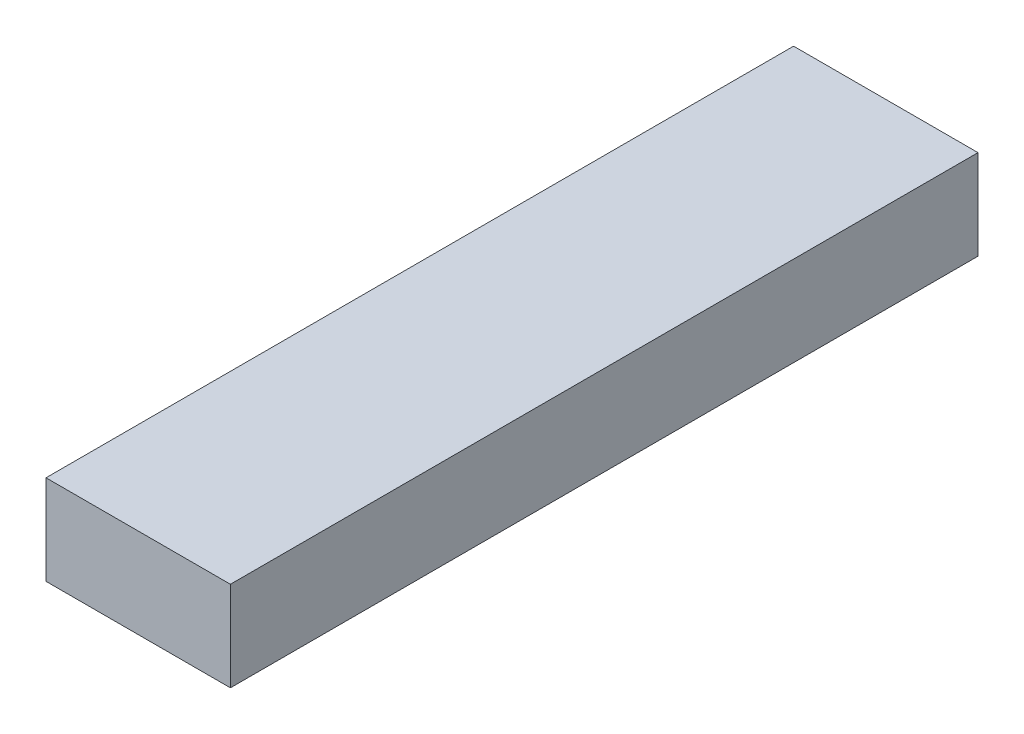
ISO-10303-21;
HEADER;
FILE_DESCRIPTION(('STEP AP214'),'2;1');
FILE_NAME('part.step','',(''),(''),'','','');
FILE_SCHEMA(('AUTOMOTIVE_DESIGN { 1 0 10303 214 1 1 1 1 }'));
ENDSEC;
DATA;
#1=APPLICATION_CONTEXT('core data for automotive mechanical design processes');
#2=APPLICATION_PROTOCOL_DEFINITION('international standard','automotive_design',2000,#1);
#3=PRODUCT_CONTEXT('',#1,'mechanical');
#4=PRODUCT('Part','Part','',(#3));
#5=PRODUCT_RELATED_PRODUCT_CATEGORY('part','',(#4));
#6=PRODUCT_DEFINITION_FORMATION('','',#4);
#7=PRODUCT_DEFINITION_CONTEXT('part definition',#1,'design');
#8=PRODUCT_DEFINITION('design','',#6,#7);
#9=PRODUCT_DEFINITION_SHAPE('','',#8);
#10=(LENGTH_UNIT() NAMED_UNIT(*) SI_UNIT(.MILLI.,.METRE.));
#11=(NAMED_UNIT(*) PLANE_ANGLE_UNIT() SI_UNIT($,.RADIAN.));
#12=(NAMED_UNIT(*) SI_UNIT($,.STERADIAN.) SOLID_ANGLE_UNIT());
#13=UNCERTAINTY_MEASURE_WITH_UNIT(LENGTH_MEASURE(1.E-05),#10,'distance_accuracy_value','');
#14=(GEOMETRIC_REPRESENTATION_CONTEXT(3) GLOBAL_UNCERTAINTY_ASSIGNED_CONTEXT((#13)) GLOBAL_UNIT_ASSIGNED_CONTEXT((#10,
#11,#12)) REPRESENTATION_CONTEXT('',''));
#15=CARTESIAN_POINT('',(0.,0.,0.));
#16=DIRECTION('',(0.,0.,1.));
#17=DIRECTION('',(1.,0.,0.));
#18=AXIS2_PLACEMENT_3D('',#15,#16,#17);
#19=CARTESIAN_POINT('',(1.85,-0.9,15.));
#20=DIRECTION('',(-1.,0.,0.));
#21=DIRECTION('',(0.,0.,1.));
#22=AXIS2_PLACEMENT_3D('',#19,#20,#21);
#23=PLANE('',#22);
#24=DIRECTION('',(0.,1.,0.));
#25=VECTOR('',#24,1.);
#26=CARTESIAN_POINT('',(1.85,-0.9,0.));
#27=LINE('',#26,#25);
#28=CARTESIAN_POINT('',(1.85,-0.9,0.));
#29=VERTEX_POINT('',#28);
#30=CARTESIAN_POINT('',(1.85,0.9,0.));
#31=VERTEX_POINT('',#30);
#32=EDGE_CURVE('E113',#29,#31,#27,.T.);
#33=ORIENTED_EDGE('',*,*,#32,.T.);
#34=DIRECTION('',(0.,0.,-1.));
#35=VECTOR('',#34,1.);
#36=CARTESIAN_POINT('',(1.85,0.9,15.));
#37=LINE('',#36,#35);
#38=CARTESIAN_POINT('',(1.85,0.9,15.));
#39=VERTEX_POINT('',#38);
#40=EDGE_CURVE('E11',#39,#31,#37,.T.);
#41=ORIENTED_EDGE('',*,*,#40,.F.);
#42=DIRECTION('',(0.,1.,0.));
#43=VECTOR('',#42,1.);
#44=CARTESIAN_POINT('',(1.85,-0.9,15.));
#45=LINE('',#44,#43);
#46=CARTESIAN_POINT('',(1.85,-0.9,15.));
#47=VERTEX_POINT('',#46);
#48=EDGE_CURVE('E97',#47,#39,#45,.T.);
#49=ORIENTED_EDGE('',*,*,#48,.F.);
#50=DIRECTION('',(0.,0.,-1.));
#51=VECTOR('',#50,1.);
#52=CARTESIAN_POINT('',(1.85,-0.9,15.));
#53=LINE('',#52,#51);
#54=EDGE_CURVE('E109',#47,#29,#53,.T.);
#55=ORIENTED_EDGE('',*,*,#54,.T.);
#56=EDGE_LOOP('',(#33,#41,#49,#55));
#57=FACE_BOUND('',#56,.T.);
#58=ADVANCED_FACE('F45',(#57),#23,.F.);
#59=CARTESIAN_POINT('',(-1.85,0.9,15.));
#60=DIRECTION('',(0.,-1.,0.));
#61=DIRECTION('',(0.,0.,-1.));
#62=AXIS2_PLACEMENT_3D('',#59,#60,#61);
#63=PLANE('',#62);
#64=DIRECTION('',(-1.,0.,0.));
#65=VECTOR('',#64,1.);
#66=CARTESIAN_POINT('',(-1.85,0.9,0.));
#67=LINE('',#66,#65);
#68=CARTESIAN_POINT('',(-1.85,0.9,0.));
#69=VERTEX_POINT('',#68);
#70=EDGE_CURVE('E102',#31,#69,#67,.T.);
#71=ORIENTED_EDGE('',*,*,#70,.T.);
#72=DIRECTION('',(0.,0.,-1.));
#73=VECTOR('',#72,1.);
#74=CARTESIAN_POINT('',(-1.85,0.9,15.));
#75=LINE('',#74,#73);
#76=CARTESIAN_POINT('',(-1.85,0.9,15.));
#77=VERTEX_POINT('',#76);
#78=EDGE_CURVE('E54',#77,#69,#75,.T.);
#79=ORIENTED_EDGE('',*,*,#78,.F.);
#80=DIRECTION('',(-1.,0.,0.));
#81=VECTOR('',#80,1.);
#82=CARTESIAN_POINT('',(-1.85,0.9,15.));
#83=LINE('',#82,#81);
#84=EDGE_CURVE('E92',#39,#77,#83,.T.);
#85=ORIENTED_EDGE('',*,*,#84,.F.);
#86=ORIENTED_EDGE('',*,*,#40,.T.);
#87=EDGE_LOOP('',(#71,#79,#85,#86));
#88=FACE_BOUND('',#87,.T.);
#89=ADVANCED_FACE('F101',(#88),#63,.F.);
#90=CARTESIAN_POINT('',(-1.85,-0.9,15.));
#91=DIRECTION('',(1.,0.,0.));
#92=DIRECTION('',(0.,0.,-1.));
#93=AXIS2_PLACEMENT_3D('',#90,#91,#92);
#94=PLANE('',#93);
#95=DIRECTION('',(0.,-1.,0.));
#96=VECTOR('',#95,1.);
#97=CARTESIAN_POINT('',(-1.85,-0.9,0.));
#98=LINE('',#97,#96);
#99=CARTESIAN_POINT('',(-1.85,-0.9,0.));
#100=VERTEX_POINT('',#99);
#101=EDGE_CURVE('E79',#69,#100,#98,.T.);
#102=ORIENTED_EDGE('',*,*,#101,.T.);
#103=DIRECTION('',(0.,0.,-1.));
#104=VECTOR('',#103,1.);
#105=CARTESIAN_POINT('',(-1.85,-0.9,15.));
#106=LINE('',#105,#104);
#107=CARTESIAN_POINT('',(-1.85,-0.9,15.));
#108=VERTEX_POINT('',#107);
#109=EDGE_CURVE('E104',#108,#100,#106,.T.);
#110=ORIENTED_EDGE('',*,*,#109,.F.);
#111=DIRECTION('',(0.,-1.,0.));
#112=VECTOR('',#111,1.);
#113=CARTESIAN_POINT('',(-1.85,-0.9,15.));
#114=LINE('',#113,#112);
#115=EDGE_CURVE('E95',#77,#108,#114,.T.);
#116=ORIENTED_EDGE('',*,*,#115,.F.);
#117=ORIENTED_EDGE('',*,*,#78,.T.);
#118=EDGE_LOOP('',(#102,#110,#116,#117));
#119=FACE_BOUND('',#118,.T.);
#120=ADVANCED_FACE('F105',(#119),#94,.F.);
#121=CARTESIAN_POINT('',(-1.85,-0.9,15.));
#122=DIRECTION('',(0.,1.,0.));
#123=DIRECTION('',(0.,0.,1.));
#124=AXIS2_PLACEMENT_3D('',#121,#122,#123);
#125=PLANE('',#124);
#126=DIRECTION('',(1.,0.,0.));
#127=VECTOR('',#126,1.);
#128=CARTESIAN_POINT('',(-1.85,-0.9,0.));
#129=LINE('',#128,#127);
#130=EDGE_CURVE('E85',#100,#29,#129,.T.);
#131=ORIENTED_EDGE('',*,*,#130,.T.);
#132=ORIENTED_EDGE('',*,*,#54,.F.);
#133=DIRECTION('',(1.,0.,0.));
#134=VECTOR('',#133,1.);
#135=CARTESIAN_POINT('',(-1.85,-0.9,15.));
#136=LINE('',#135,#134);
#137=EDGE_CURVE('E62',#108,#47,#136,.T.);
#138=ORIENTED_EDGE('',*,*,#137,.F.);
#139=ORIENTED_EDGE('',*,*,#109,.T.);
#140=EDGE_LOOP('',(#131,#132,#138,#139));
#141=FACE_BOUND('',#140,.T.);
#142=ADVANCED_FACE('F126',(#141),#125,.F.);
#143=CARTESIAN_POINT('',(0.,0.,15.));
#144=DIRECTION('',(0.,0.,-1.));
#145=DIRECTION('',(-1.,0.,0.));
#146=AXIS2_PLACEMENT_3D('',#143,#144,#145);
#147=PLANE('',#146);
#148=ORIENTED_EDGE('',*,*,#48,.T.);
#149=ORIENTED_EDGE('',*,*,#84,.T.);
#150=ORIENTED_EDGE('',*,*,#115,.T.);
#151=ORIENTED_EDGE('',*,*,#137,.T.);
#152=EDGE_LOOP('',(#148,#149,#150,#151));
#153=FACE_BOUND('',#152,.T.);
#154=ADVANCED_FACE('F93',(#153),#147,.F.);
#155=CARTESIAN_POINT('',(0.,0.,0.));
#156=DIRECTION('',(0.,0.,-1.));
#157=DIRECTION('',(-1.,0.,0.));
#158=AXIS2_PLACEMENT_3D('',#155,#156,#157);
#159=PLANE('',#158);
#160=ORIENTED_EDGE('',*,*,#32,.F.);
#161=ORIENTED_EDGE('',*,*,#130,.F.);
#162=ORIENTED_EDGE('',*,*,#101,.F.);
#163=ORIENTED_EDGE('',*,*,#70,.F.);
#164=EDGE_LOOP('',(#160,#161,#162,#163));
#165=FACE_BOUND('',#164,.T.);
#166=ADVANCED_FACE('F129',(#165),#159,.T.);
#167=CLOSED_SHELL('',(#58,#89,#120,#142,#154,#166));
#168=MANIFOLD_SOLID_BREP('B2',#167);
#169=ADVANCED_BREP_SHAPE_REPRESENTATION('',(#18,#168),#14);
#170=SHAPE_DEFINITION_REPRESENTATION(#9,#169);
ENDSEC;
END-ISO-10303-21;
